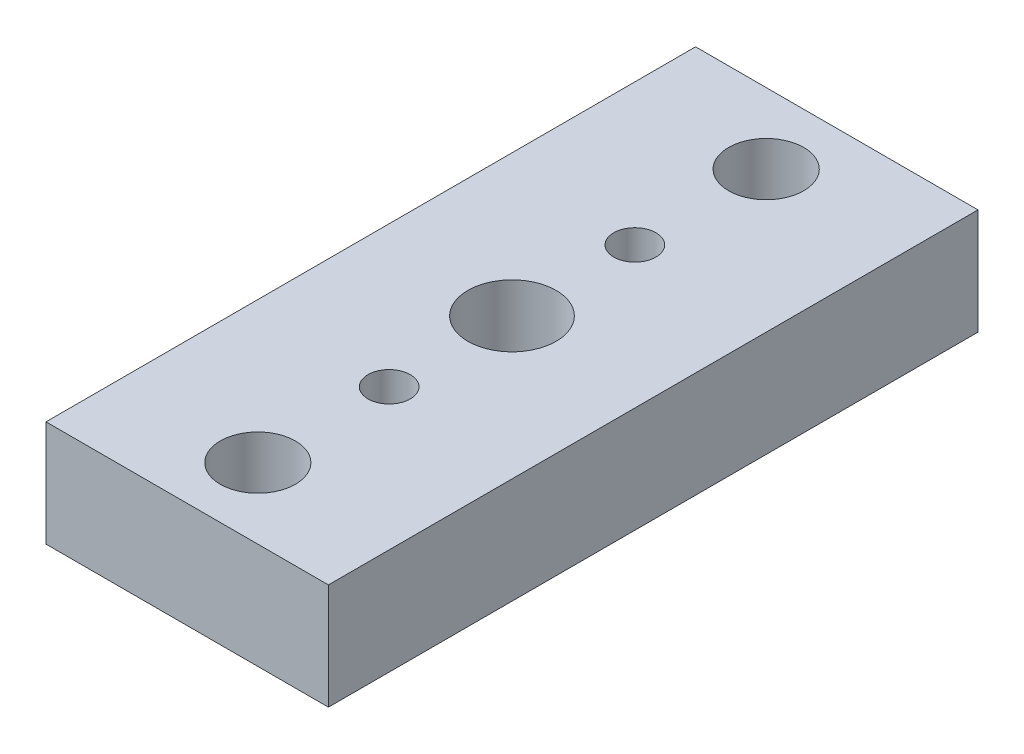
ISO-10303-21;
HEADER;
FILE_DESCRIPTION(('STEP AP214'),'2;1');
FILE_NAME('part.step','',(''),(''),'','','');
FILE_SCHEMA(('AUTOMOTIVE_DESIGN { 1 0 10303 214 1 1 1 1 }'));
ENDSEC;
DATA;
#1=APPLICATION_CONTEXT('core data for automotive mechanical design processes');
#2=APPLICATION_PROTOCOL_DEFINITION('international standard','automotive_design',2000,#1);
#3=PRODUCT_CONTEXT('',#1,'mechanical');
#4=PRODUCT('Part','Part','',(#3));
#5=PRODUCT_RELATED_PRODUCT_CATEGORY('part','',(#4));
#6=PRODUCT_DEFINITION_FORMATION('','',#4);
#7=PRODUCT_DEFINITION_CONTEXT('part definition',#1,'design');
#8=PRODUCT_DEFINITION('design','',#6,#7);
#9=PRODUCT_DEFINITION_SHAPE('','',#8);
#10=(LENGTH_UNIT() NAMED_UNIT(*) SI_UNIT(.MILLI.,.METRE.));
#11=(NAMED_UNIT(*) PLANE_ANGLE_UNIT() SI_UNIT($,.RADIAN.));
#12=(NAMED_UNIT(*) SI_UNIT($,.STERADIAN.) SOLID_ANGLE_UNIT());
#13=UNCERTAINTY_MEASURE_WITH_UNIT(LENGTH_MEASURE(1.E-05),#10,'distance_accuracy_value','');
#14=(GEOMETRIC_REPRESENTATION_CONTEXT(3) GLOBAL_UNCERTAINTY_ASSIGNED_CONTEXT((#13)) GLOBAL_UNIT_ASSIGNED_CONTEXT((#10,
#11,#12)) REPRESENTATION_CONTEXT('',''));
#15=CARTESIAN_POINT('',(0.,0.,0.));
#16=DIRECTION('',(0.,0.,1.));
#17=DIRECTION('',(1.,0.,0.));
#18=AXIS2_PLACEMENT_3D('',#15,#16,#17);
#19=CARTESIAN_POINT('',(-12.7,4.7625,58.42));
#20=DIRECTION('',(0.,-1.,0.));
#21=DIRECTION('',(0.,0.,-1.));
#22=AXIS2_PLACEMENT_3D('',#19,#20,#21);
#23=PLANE('',#22);
#24=CARTESIAN_POINT('',(0.,4.7625,18.161));
#25=DIRECTION('',(0.,1.,0.));
#26=DIRECTION('',(0.,0.,1.));
#27=AXIS2_PLACEMENT_3D('',#24,#25,#26);
#28=CIRCLE('',#27,1.89865);
#29=CARTESIAN_POINT('',(0.,4.7625,20.05965));
#30=VERTEX_POINT('',#29);
#31=EDGE_CURVE('E136',#30,#30,#28,.T.);
#32=ORIENTED_EDGE('',*,*,#31,.F.);
#33=EDGE_LOOP('',(#32));
#34=FACE_BOUND('',#33,.T.);
#35=CARTESIAN_POINT('',(0.,4.7625,40.259));
#36=DIRECTION('',(0.,1.,0.));
#37=DIRECTION('',(0.,0.,1.));
#38=AXIS2_PLACEMENT_3D('',#35,#36,#37);
#39=CIRCLE('',#38,1.89865);
#40=CARTESIAN_POINT('',(0.,4.7625,42.15765));
#41=VERTEX_POINT('',#40);
#42=EDGE_CURVE('E130',#41,#41,#39,.T.);
#43=ORIENTED_EDGE('',*,*,#42,.F.);
#44=EDGE_LOOP('',(#43));
#45=FACE_BOUND('',#44,.T.);
#46=CARTESIAN_POINT('',(0.,4.7625,29.21));
#47=DIRECTION('',(0.,1.,0.));
#48=DIRECTION('',(0.,0.,1.));
#49=AXIS2_PLACEMENT_3D('',#46,#47,#48);
#50=CIRCLE('',#49,3.96875);
#51=CARTESIAN_POINT('',(0.,4.7625,33.17875));
#52=VERTEX_POINT('',#51);
#53=EDGE_CURVE('E124',#52,#52,#50,.T.);
#54=ORIENTED_EDGE('',*,*,#53,.F.);
#55=EDGE_LOOP('',(#54));
#56=FACE_BOUND('',#55,.T.);
#57=CARTESIAN_POINT('',(0.,4.7625,6.35));
#58=DIRECTION('',(0.,1.,0.));
#59=DIRECTION('',(0.,0.,1.));
#60=AXIS2_PLACEMENT_3D('',#57,#58,#59);
#61=CIRCLE('',#60,3.3782);
#62=CARTESIAN_POINT('',(0.,4.7625,9.7282));
#63=VERTEX_POINT('',#62);
#64=EDGE_CURVE('E117',#63,#63,#61,.T.);
#65=ORIENTED_EDGE('',*,*,#64,.F.);
#66=EDGE_LOOP('',(#65));
#67=FACE_BOUND('',#66,.T.);
#68=CARTESIAN_POINT('',(0.,4.7625,52.07));
#69=DIRECTION('',(0.,1.,0.));
#70=DIRECTION('',(0.,0.,1.));
#71=AXIS2_PLACEMENT_3D('',#68,#69,#70);
#72=CIRCLE('',#71,3.3782);
#73=CARTESIAN_POINT('',(0.,4.7625,55.4482));
#74=VERTEX_POINT('',#73);
#75=EDGE_CURVE('E109',#74,#74,#72,.T.);
#76=ORIENTED_EDGE('',*,*,#75,.F.);
#77=EDGE_LOOP('',(#76));
#78=FACE_BOUND('',#77,.T.);
#79=DIRECTION('',(-1.,0.,0.));
#80=VECTOR('',#79,1.);
#81=CARTESIAN_POINT('',(-12.7,4.7625,0.));
#82=LINE('',#81,#80);
#83=CARTESIAN_POINT('',(12.7,4.7625,0.));
#84=VERTEX_POINT('',#83);
#85=CARTESIAN_POINT('',(-12.7,4.7625,0.));
#86=VERTEX_POINT('',#85);
#87=EDGE_CURVE('E100',#84,#86,#82,.T.);
#88=ORIENTED_EDGE('',*,*,#87,.T.);
#89=DIRECTION('',(0.,0.,-1.));
#90=VECTOR('',#89,1.);
#91=CARTESIAN_POINT('',(-12.7,4.7625,58.42));
#92=LINE('',#91,#90);
#93=CARTESIAN_POINT('',(-12.7,4.7625,58.42));
#94=VERTEX_POINT('',#93);
#95=EDGE_CURVE('E11',#94,#86,#92,.T.);
#96=ORIENTED_EDGE('',*,*,#95,.F.);
#97=DIRECTION('',(-1.,0.,0.));
#98=VECTOR('',#97,1.);
#99=CARTESIAN_POINT('',(-12.7,4.7625,58.42));
#100=LINE('',#99,#98);
#101=CARTESIAN_POINT('',(12.7,4.7625,58.42));
#102=VERTEX_POINT('',#101);
#103=EDGE_CURVE('E87',#102,#94,#100,.T.);
#104=ORIENTED_EDGE('',*,*,#103,.F.);
#105=DIRECTION('',(0.,0.,-1.));
#106=VECTOR('',#105,1.);
#107=CARTESIAN_POINT('',(12.7,4.7625,58.42));
#108=LINE('',#107,#106);
#109=EDGE_CURVE('E96',#102,#84,#108,.T.);
#110=ORIENTED_EDGE('',*,*,#109,.T.);
#111=EDGE_LOOP('',(#88,#96,#104,#110));
#112=FACE_BOUND('',#111,.T.);
#113=ADVANCED_FACE('F34',(#34,#45,#56,#67,#78,#112),#23,.F.);
#114=CARTESIAN_POINT('',(-12.7,-4.7625,58.42));
#115=DIRECTION('',(1.,0.,0.));
#116=DIRECTION('',(0.,0.,-1.));
#117=AXIS2_PLACEMENT_3D('',#114,#115,#116);
#118=PLANE('',#117);
#119=DIRECTION('',(0.,-1.,0.));
#120=VECTOR('',#119,1.);
#121=CARTESIAN_POINT('',(-12.7,-4.7625,0.));
#122=LINE('',#121,#120);
#123=CARTESIAN_POINT('',(-12.7,-4.7625,0.));
#124=VERTEX_POINT('',#123);
#125=EDGE_CURVE('E91',#86,#124,#122,.T.);
#126=ORIENTED_EDGE('',*,*,#125,.T.);
#127=DIRECTION('',(0.,0.,-1.));
#128=VECTOR('',#127,1.);
#129=CARTESIAN_POINT('',(-12.7,-4.7625,58.42));
#130=LINE('',#129,#128);
#131=CARTESIAN_POINT('',(-12.7,-4.7625,58.42));
#132=VERTEX_POINT('',#131);
#133=EDGE_CURVE('E43',#132,#124,#130,.T.);
#134=ORIENTED_EDGE('',*,*,#133,.F.);
#135=DIRECTION('',(0.,-1.,0.));
#136=VECTOR('',#135,1.);
#137=CARTESIAN_POINT('',(-12.7,-4.7625,58.42));
#138=LINE('',#137,#136);
#139=EDGE_CURVE('E82',#94,#132,#138,.T.);
#140=ORIENTED_EDGE('',*,*,#139,.F.);
#141=ORIENTED_EDGE('',*,*,#95,.T.);
#142=EDGE_LOOP('',(#126,#134,#140,#141));
#143=FACE_BOUND('',#142,.T.);
#144=ADVANCED_FACE('F90',(#143),#118,.F.);
#145=CARTESIAN_POINT('',(-12.7,-4.7625,58.42));
#146=DIRECTION('',(0.,1.,0.));
#147=DIRECTION('',(0.,0.,1.));
#148=AXIS2_PLACEMENT_3D('',#145,#146,#147);
#149=PLANE('',#148);
#150=CARTESIAN_POINT('',(0.,-4.7625,18.161));
#151=DIRECTION('',(0.,1.,0.));
#152=DIRECTION('',(0.,0.,1.));
#153=AXIS2_PLACEMENT_3D('',#150,#151,#152);
#154=CIRCLE('',#153,1.89865);
#155=CARTESIAN_POINT('',(0.,-4.7625,20.05965));
#156=VERTEX_POINT('',#155);
#157=EDGE_CURVE('E133',#156,#156,#154,.T.);
#158=ORIENTED_EDGE('',*,*,#157,.T.);
#159=EDGE_LOOP('',(#158));
#160=FACE_BOUND('',#159,.T.);
#161=CARTESIAN_POINT('',(0.,-4.7625,40.259));
#162=DIRECTION('',(0.,1.,0.));
#163=DIRECTION('',(0.,0.,1.));
#164=AXIS2_PLACEMENT_3D('',#161,#162,#163);
#165=CIRCLE('',#164,1.89865);
#166=CARTESIAN_POINT('',(0.,-4.7625,42.15765));
#167=VERTEX_POINT('',#166);
#168=EDGE_CURVE('E127',#167,#167,#165,.T.);
#169=ORIENTED_EDGE('',*,*,#168,.T.);
#170=EDGE_LOOP('',(#169));
#171=FACE_BOUND('',#170,.T.);
#172=CARTESIAN_POINT('',(0.,-4.7625,29.21));
#173=DIRECTION('',(0.,1.,0.));
#174=DIRECTION('',(0.,0.,1.));
#175=AXIS2_PLACEMENT_3D('',#172,#173,#174);
#176=CIRCLE('',#175,3.96875);
#177=CARTESIAN_POINT('',(0.,-4.7625,33.17875));
#178=VERTEX_POINT('',#177);
#179=EDGE_CURVE('E121',#178,#178,#176,.T.);
#180=ORIENTED_EDGE('',*,*,#179,.T.);
#181=EDGE_LOOP('',(#180));
#182=FACE_BOUND('',#181,.T.);
#183=CARTESIAN_POINT('',(0.,-4.7625,6.35));
#184=DIRECTION('',(0.,1.,0.));
#185=DIRECTION('',(0.,0.,1.));
#186=AXIS2_PLACEMENT_3D('',#183,#184,#185);
#187=CIRCLE('',#186,3.3782);
#188=CARTESIAN_POINT('',(0.,-4.7625,9.7282));
#189=VERTEX_POINT('',#188);
#190=EDGE_CURVE('E37',#189,#189,#187,.T.);
#191=ORIENTED_EDGE('',*,*,#190,.T.);
#192=EDGE_LOOP('',(#191));
#193=FACE_BOUND('',#192,.T.);
#194=CARTESIAN_POINT('',(0.,-4.7625,52.07));
#195=DIRECTION('',(0.,1.,0.));
#196=DIRECTION('',(0.,0.,1.));
#197=AXIS2_PLACEMENT_3D('',#194,#195,#196);
#198=CIRCLE('',#197,3.3782);
#199=CARTESIAN_POINT('',(0.,-4.7625,55.4482));
#200=VERTEX_POINT('',#199);
#201=EDGE_CURVE('E103',#200,#200,#198,.T.);
#202=ORIENTED_EDGE('',*,*,#201,.T.);
#203=EDGE_LOOP('',(#202));
#204=FACE_BOUND('',#203,.T.);
#205=DIRECTION('',(1.,0.,0.));
#206=VECTOR('',#205,1.);
#207=CARTESIAN_POINT('',(-12.7,-4.7625,0.));
#208=LINE('',#207,#206);
#209=CARTESIAN_POINT('',(12.7,-4.7625,0.));
#210=VERTEX_POINT('',#209);
#211=EDGE_CURVE('E69',#124,#210,#208,.T.);
#212=ORIENTED_EDGE('',*,*,#211,.T.);
#213=DIRECTION('',(0.,0.,-1.));
#214=VECTOR('',#213,1.);
#215=CARTESIAN_POINT('',(12.7,-4.7625,58.42));
#216=LINE('',#215,#214);
#217=CARTESIAN_POINT('',(12.7,-4.7625,58.42));
#218=VERTEX_POINT('',#217);
#219=EDGE_CURVE('E92',#218,#210,#216,.T.);
#220=ORIENTED_EDGE('',*,*,#219,.F.);
#221=DIRECTION('',(1.,0.,0.));
#222=VECTOR('',#221,1.);
#223=CARTESIAN_POINT('',(-12.7,-4.7625,58.42));
#224=LINE('',#223,#222);
#225=EDGE_CURVE('E85',#132,#218,#224,.T.);
#226=ORIENTED_EDGE('',*,*,#225,.F.);
#227=ORIENTED_EDGE('',*,*,#133,.T.);
#228=EDGE_LOOP('',(#212,#220,#226,#227));
#229=FACE_BOUND('',#228,.T.);
#230=ADVANCED_FACE('F94',(#160,#171,#182,#193,#204,#229),#149,.F.);
#231=CARTESIAN_POINT('',(12.7,-4.7625,58.42));
#232=DIRECTION('',(-1.,0.,0.));
#233=DIRECTION('',(0.,-1.,0.));
#234=AXIS2_PLACEMENT_3D('',#231,#232,#233);
#235=PLANE('',#234);
#236=DIRECTION('',(0.,1.,0.));
#237=VECTOR('',#236,1.);
#238=CARTESIAN_POINT('',(12.7,-4.7625,0.));
#239=LINE('',#238,#237);
#240=EDGE_CURVE('E75',#210,#84,#239,.T.);
#241=ORIENTED_EDGE('',*,*,#240,.T.);
#242=ORIENTED_EDGE('',*,*,#109,.F.);
#243=DIRECTION('',(0.,1.,0.));
#244=VECTOR('',#243,1.);
#245=CARTESIAN_POINT('',(12.7,-4.7625,58.42));
#246=LINE('',#245,#244);
#247=EDGE_CURVE('E52',#218,#102,#246,.T.);
#248=ORIENTED_EDGE('',*,*,#247,.F.);
#249=ORIENTED_EDGE('',*,*,#219,.T.);
#250=EDGE_LOOP('',(#241,#242,#248,#249));
#251=FACE_BOUND('',#250,.T.);
#252=ADVANCED_FACE('F163',(#251),#235,.F.);
#253=CARTESIAN_POINT('',(12.7,4.7625,58.42));
#254=DIRECTION('',(0.,0.,1.));
#255=DIRECTION('',(1.,0.,0.));
#256=AXIS2_PLACEMENT_3D('',#253,#254,#255);
#257=PLANE('',#256);
#258=ORIENTED_EDGE('',*,*,#103,.T.);
#259=ORIENTED_EDGE('',*,*,#139,.T.);
#260=ORIENTED_EDGE('',*,*,#225,.T.);
#261=ORIENTED_EDGE('',*,*,#247,.T.);
#262=EDGE_LOOP('',(#258,#259,#260,#261));
#263=FACE_BOUND('',#262,.T.);
#264=ADVANCED_FACE('F83',(#263),#257,.T.);
#265=CARTESIAN_POINT('',(12.7,4.7625,0.));
#266=DIRECTION('',(0.,0.,1.));
#267=DIRECTION('',(1.,0.,0.));
#268=AXIS2_PLACEMENT_3D('',#265,#266,#267);
#269=PLANE('',#268);
#270=ORIENTED_EDGE('',*,*,#87,.F.);
#271=ORIENTED_EDGE('',*,*,#240,.F.);
#272=ORIENTED_EDGE('',*,*,#211,.F.);
#273=ORIENTED_EDGE('',*,*,#125,.F.);
#274=EDGE_LOOP('',(#270,#271,#272,#273));
#275=FACE_BOUND('',#274,.T.);
#276=ADVANCED_FACE('F153',(#275),#269,.F.);
#277=CARTESIAN_POINT('',(0.,4.7625,52.07));
#278=DIRECTION('',(0.,1.,0.));
#279=DIRECTION('',(0.,0.,1.));
#280=AXIS2_PLACEMENT_3D('',#277,#278,#279);
#281=CYLINDRICAL_SURFACE('',#280,3.3782);
#282=ORIENTED_EDGE('',*,*,#75,.T.);
#283=EDGE_LOOP('',(#282));
#284=FACE_BOUND('',#283,.T.);
#285=ORIENTED_EDGE('',*,*,#201,.F.);
#286=EDGE_LOOP('',(#285));
#287=FACE_BOUND('',#286,.T.);
#288=ADVANCED_FACE('F155',(#284,#287),#281,.F.);
#289=CARTESIAN_POINT('',(0.,4.7625,6.35));
#290=DIRECTION('',(0.,1.,0.));
#291=DIRECTION('',(0.,0.,1.));
#292=AXIS2_PLACEMENT_3D('',#289,#290,#291);
#293=CYLINDRICAL_SURFACE('',#292,3.3782);
#294=ORIENTED_EDGE('',*,*,#64,.T.);
#295=EDGE_LOOP('',(#294));
#296=FACE_BOUND('',#295,.T.);
#297=ORIENTED_EDGE('',*,*,#190,.F.);
#298=EDGE_LOOP('',(#297));
#299=FACE_BOUND('',#298,.T.);
#300=ADVANCED_FACE('F161',(#296,#299),#293,.F.);
#301=CARTESIAN_POINT('',(0.,4.7625,29.21));
#302=DIRECTION('',(0.,1.,0.));
#303=DIRECTION('',(0.,0.,1.));
#304=AXIS2_PLACEMENT_3D('',#301,#302,#303);
#305=CYLINDRICAL_SURFACE('',#304,3.96875);
#306=ORIENTED_EDGE('',*,*,#179,.F.);
#307=EDGE_LOOP('',(#306));
#308=FACE_BOUND('',#307,.T.);
#309=ORIENTED_EDGE('',*,*,#53,.T.);
#310=EDGE_LOOP('',(#309));
#311=FACE_BOUND('',#310,.T.);
#312=ADVANCED_FACE('F207',(#308,#311),#305,.F.);
#313=CARTESIAN_POINT('',(0.,4.7625,40.259));
#314=DIRECTION('',(0.,1.,0.));
#315=DIRECTION('',(0.,0.,1.));
#316=AXIS2_PLACEMENT_3D('',#313,#314,#315);
#317=CYLINDRICAL_SURFACE('',#316,1.89865);
#318=ORIENTED_EDGE('',*,*,#168,.F.);
#319=EDGE_LOOP('',(#318));
#320=FACE_BOUND('',#319,.T.);
#321=ORIENTED_EDGE('',*,*,#42,.T.);
#322=EDGE_LOOP('',(#321));
#323=FACE_BOUND('',#322,.T.);
#324=ADVANCED_FACE('F217',(#320,#323),#317,.F.);
#325=CARTESIAN_POINT('',(0.,4.7625,18.161));
#326=DIRECTION('',(0.,1.,0.));
#327=DIRECTION('',(0.,0.,1.));
#328=AXIS2_PLACEMENT_3D('',#325,#326,#327);
#329=CYLINDRICAL_SURFACE('',#328,1.89865);
#330=ORIENTED_EDGE('',*,*,#157,.F.);
#331=EDGE_LOOP('',(#330));
#332=FACE_BOUND('',#331,.T.);
#333=ORIENTED_EDGE('',*,*,#31,.T.);
#334=EDGE_LOOP('',(#333));
#335=FACE_BOUND('',#334,.T.);
#336=ADVANCED_FACE('F140',(#332,#335),#329,.F.);
#337=CLOSED_SHELL('',(#113,#144,#230,#252,#264,#276,#288,#300,#312,#324,#336));
#338=MANIFOLD_SOLID_BREP('B2',#337);
#339=ADVANCED_BREP_SHAPE_REPRESENTATION('',(#18,#338),#14);
#340=SHAPE_DEFINITION_REPRESENTATION(#9,#339);
ENDSEC;
END-ISO-10303-21;
